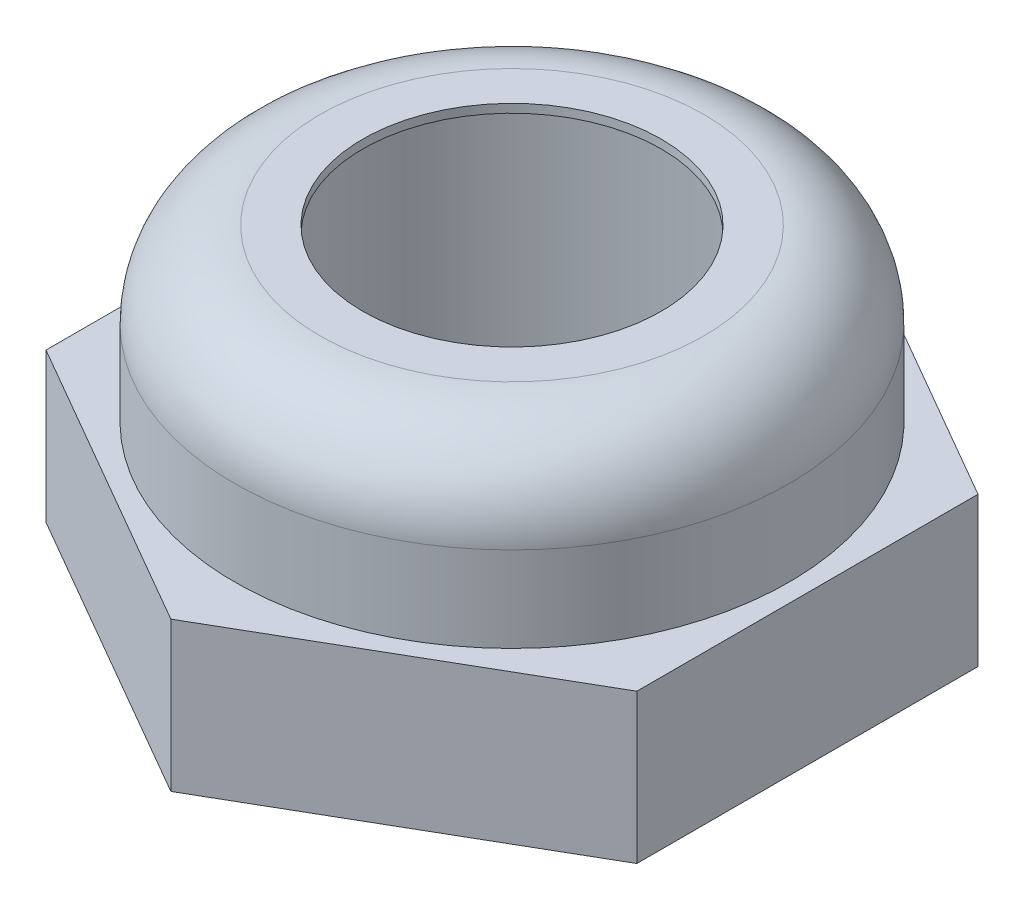
ISO-10303-21;
HEADER;
FILE_DESCRIPTION(('STEP AP214'),'2;1');
FILE_NAME('part.step','',(''),(''),'','','');
FILE_SCHEMA(('AUTOMOTIVE_DESIGN { 1 0 10303 214 1 1 1 1 }'));
ENDSEC;
DATA;
#1=APPLICATION_CONTEXT('core data for automotive mechanical design processes');
#2=APPLICATION_PROTOCOL_DEFINITION('international standard','automotive_design',2000,#1);
#3=PRODUCT_CONTEXT('',#1,'mechanical');
#4=PRODUCT('Part','Part','',(#3));
#5=PRODUCT_RELATED_PRODUCT_CATEGORY('part','',(#4));
#6=PRODUCT_DEFINITION_FORMATION('','',#4);
#7=PRODUCT_DEFINITION_CONTEXT('part definition',#1,'design');
#8=PRODUCT_DEFINITION('design','',#6,#7);
#9=PRODUCT_DEFINITION_SHAPE('','',#8);
#10=(LENGTH_UNIT() NAMED_UNIT(*) SI_UNIT(.MILLI.,.METRE.));
#11=(NAMED_UNIT(*) PLANE_ANGLE_UNIT() SI_UNIT($,.RADIAN.));
#12=(NAMED_UNIT(*) SI_UNIT($,.STERADIAN.) SOLID_ANGLE_UNIT());
#13=UNCERTAINTY_MEASURE_WITH_UNIT(LENGTH_MEASURE(1.E-05),#10,'distance_accuracy_value','');
#14=(GEOMETRIC_REPRESENTATION_CONTEXT(3) GLOBAL_UNCERTAINTY_ASSIGNED_CONTEXT((#13)) GLOBAL_UNIT_ASSIGNED_CONTEXT((#10,
#11,#12)) REPRESENTATION_CONTEXT('',''));
#15=CARTESIAN_POINT('',(0.,0.,0.));
#16=DIRECTION('',(0.,0.,1.));
#17=DIRECTION('',(1.,0.,0.));
#18=AXIS2_PLACEMENT_3D('',#15,#16,#17);
#19=CARTESIAN_POINT('',(-6.5,-3.47319206126624,0.));
#20=DIRECTION('',(0.,-1.,0.));
#21=DIRECTION('',(0.,0.,-1.));
#22=AXIS2_PLACEMENT_3D('',#19,#20,#21);
#23=PLANE('',#22);
#24=CARTESIAN_POINT('',(0.,-3.47319206126623,0.));
#25=DIRECTION('',(0.,-1.,0.));
#26=DIRECTION('',(0.,0.,-1.));
#27=AXIS2_PLACEMENT_3D('',#24,#25,#26);
#28=CIRCLE('',#27,6.5);
#29=CARTESIAN_POINT('',(0.,-3.47319206126623,-6.5));
#30=VERTEX_POINT('',#29);
#31=EDGE_CURVE('E172',#30,#30,#28,.T.);
#32=ORIENTED_EDGE('',*,*,#31,.T.);
#33=EDGE_LOOP('',(#32));
#34=FACE_BOUND('',#33,.T.);
#35=DIRECTION('',(-0.866025403784439,0.,0.5));
#36=VECTOR('',#35,1.);
#37=CARTESIAN_POINT('',(-6.92820323027551,-3.47319206126624,-4.));
#38=LINE('',#37,#36);
#39=CARTESIAN_POINT('',(0.,-3.47319206126624,-8.));
#40=VERTEX_POINT('',#39);
#41=CARTESIAN_POINT('',(-6.92820323027551,-3.47319206126624,-4.));
#42=VERTEX_POINT('',#41);
#43=EDGE_CURVE('E109',#40,#42,#38,.T.);
#44=ORIENTED_EDGE('',*,*,#43,.T.);
#45=DIRECTION('',(0.,0.,1.));
#46=VECTOR('',#45,1.);
#47=CARTESIAN_POINT('',(-6.92820323027551,-3.47319206126624,4.));
#48=LINE('',#47,#46);
#49=CARTESIAN_POINT('',(-6.92820323027551,-3.47319206126624,4.));
#50=VERTEX_POINT('',#49);
#51=EDGE_CURVE('E107',#42,#50,#48,.T.);
#52=ORIENTED_EDGE('',*,*,#51,.T.);
#53=DIRECTION('',(0.866025403784439,0.,0.5));
#54=VECTOR('',#53,1.);
#55=CARTESIAN_POINT('',(0.,-3.47319206126624,8.));
#56=LINE('',#55,#54);
#57=CARTESIAN_POINT('',(0.,-3.47319206126624,8.));
#58=VERTEX_POINT('',#57);
#59=EDGE_CURVE('E50',#50,#58,#56,.T.);
#60=ORIENTED_EDGE('',*,*,#59,.T.);
#61=DIRECTION('',(0.866025403784439,0.,-0.5));
#62=VECTOR('',#61,1.);
#63=CARTESIAN_POINT('',(6.92820323027551,-3.47319206126624,4.));
#64=LINE('',#63,#62);
#65=CARTESIAN_POINT('',(6.92820323027551,-3.47319206126624,4.));
#66=VERTEX_POINT('',#65);
#67=EDGE_CURVE('E97',#58,#66,#64,.T.);
#68=ORIENTED_EDGE('',*,*,#67,.T.);
#69=DIRECTION('',(0.,0.,-1.));
#70=VECTOR('',#69,1.);
#71=CARTESIAN_POINT('',(6.92820323027551,-3.47319206126624,-4.));
#72=LINE('',#71,#70);
#73=CARTESIAN_POINT('',(6.92820323027551,-3.47319206126624,-4.));
#74=VERTEX_POINT('',#73);
#75=EDGE_CURVE('E103',#66,#74,#72,.T.);
#76=ORIENTED_EDGE('',*,*,#75,.T.);
#77=DIRECTION('',(-0.866025403784439,0.,-0.5));
#78=VECTOR('',#77,1.);
#79=CARTESIAN_POINT('',(0.,-3.47319206126624,-8.));
#80=LINE('',#79,#78);
#81=EDGE_CURVE('E114',#74,#40,#80,.T.);
#82=ORIENTED_EDGE('',*,*,#81,.T.);
#83=EDGE_LOOP('',(#44,#52,#60,#68,#76,#82));
#84=FACE_BOUND('',#83,.T.);
#85=ADVANCED_FACE('F35',(#34,#84),#23,.F.);
#86=CARTESIAN_POINT('',(-8.,-6.97319206126624,0.));
#87=DIRECTION('',(0.,1.,0.));
#88=DIRECTION('',(0.,0.,1.));
#89=AXIS2_PLACEMENT_3D('',#86,#87,#88);
#90=PLANE('',#89);
#91=CARTESIAN_POINT('',(0.,-6.97319206126624,0.));
#92=DIRECTION('',(0.,-1.,0.));
#93=DIRECTION('',(0.,0.,-1.));
#94=AXIS2_PLACEMENT_3D('',#91,#92,#93);
#95=CIRCLE('',#94,6.);
#96=CARTESIAN_POINT('',(0.,-6.97319206126624,-6.));
#97=VERTEX_POINT('',#96);
#98=EDGE_CURVE('E223',#97,#97,#95,.T.);
#99=ORIENTED_EDGE('',*,*,#98,.F.);
#100=EDGE_LOOP('',(#99));
#101=FACE_BOUND('',#100,.T.);
#102=DIRECTION('',(-0.866025403784439,0.,0.5));
#103=VECTOR('',#102,1.);
#104=CARTESIAN_POINT('',(-9.46410161513776,-6.97319206126624,-2.53589838486225));
#105=LINE('',#104,#103);
#106=CARTESIAN_POINT('',(0.,-6.97319206126624,-8.));
#107=VERTEX_POINT('',#106);
#108=CARTESIAN_POINT('',(-6.92820323027551,-6.97319206126624,-4.));
#109=VERTEX_POINT('',#108);
#110=EDGE_CURVE('E11',#107,#109,#105,.T.);
#111=ORIENTED_EDGE('',*,*,#110,.F.);
#112=DIRECTION('',(-0.866025403784439,0.,-0.5));
#113=VECTOR('',#112,1.);
#114=CARTESIAN_POINT('',(-2.53589838486225,-6.97319206126624,-9.46410161513775));
#115=LINE('',#114,#113);
#116=CARTESIAN_POINT('',(6.92820323027551,-6.97319206126624,-4.));
#117=VERTEX_POINT('',#116);
#118=EDGE_CURVE('E43',#117,#107,#115,.T.);
#119=ORIENTED_EDGE('',*,*,#118,.F.);
#120=DIRECTION('',(0.,0.,-1.));
#121=VECTOR('',#120,1.);
#122=CARTESIAN_POINT('',(6.92820323027551,-6.97319206126624,0.));
#123=LINE('',#122,#121);
#124=CARTESIAN_POINT('',(6.92820323027551,-6.97319206126624,4.));
#125=VERTEX_POINT('',#124);
#126=EDGE_CURVE('E179',#125,#117,#123,.T.);
#127=ORIENTED_EDGE('',*,*,#126,.F.);
#128=DIRECTION('',(0.866025403784439,0.,-0.5));
#129=VECTOR('',#128,1.);
#130=CARTESIAN_POINT('',(-2.53589838486224,-6.97319206126624,9.46410161513775));
#131=LINE('',#130,#129);
#132=CARTESIAN_POINT('',(0.,-6.97319206126624,8.));
#133=VERTEX_POINT('',#132);
#134=EDGE_CURVE('E177',#133,#125,#131,.T.);
#135=ORIENTED_EDGE('',*,*,#134,.F.);
#136=DIRECTION('',(0.866025403784439,0.,0.5));
#137=VECTOR('',#136,1.);
#138=CARTESIAN_POINT('',(-9.46410161513776,-6.97319206126624,2.53589838486225));
#139=LINE('',#138,#137);
#140=CARTESIAN_POINT('',(-6.92820323027551,-6.97319206126624,4.));
#141=VERTEX_POINT('',#140);
#142=EDGE_CURVE('E90',#141,#133,#139,.T.);
#143=ORIENTED_EDGE('',*,*,#142,.F.);
#144=DIRECTION('',(0.,0.,1.));
#145=VECTOR('',#144,1.);
#146=CARTESIAN_POINT('',(-6.92820323027551,-6.97319206126624,0.));
#147=LINE('',#146,#145);
#148=EDGE_CURVE('E169',#109,#141,#147,.T.);
#149=ORIENTED_EDGE('',*,*,#148,.F.);
#150=EDGE_LOOP('',(#111,#119,#127,#135,#143,#149));
#151=FACE_BOUND('',#150,.T.);
#152=ADVANCED_FACE('F146',(#101,#151),#90,.F.);
#153=CARTESIAN_POINT('',(-4.49999999999998,0.526807938733765,0.));
#154=DIRECTION('',(0.,-1.,0.));
#155=DIRECTION('',(0.,0.,-1.));
#156=AXIS2_PLACEMENT_3D('',#153,#154,#155);
#157=PLANE('',#156);
#158=CARTESIAN_POINT('',(0.,0.526807938733766,0.));
#159=DIRECTION('',(0.,-1.,0.));
#160=DIRECTION('',(0.,0.,-1.));
#161=AXIS2_PLACEMENT_3D('',#158,#159,#160);
#162=CIRCLE('',#161,4.49999999999999);
#163=CARTESIAN_POINT('',(0.,0.526807938733766,-4.49999999999999));
#164=VERTEX_POINT('',#163);
#165=EDGE_CURVE('E168',#164,#164,#162,.T.);
#166=ORIENTED_EDGE('',*,*,#165,.F.);
#167=EDGE_LOOP('',(#166));
#168=FACE_BOUND('',#167,.T.);
#169=CARTESIAN_POINT('',(0.,0.526807938733766,0.));
#170=DIRECTION('',(0.,-1.,0.));
#171=DIRECTION('',(0.,0.,-1.));
#172=AXIS2_PLACEMENT_3D('',#169,#170,#171);
#173=CIRCLE('',#172,3.5);
#174=CARTESIAN_POINT('',(0.,0.526807938733766,-3.5));
#175=VERTEX_POINT('',#174);
#176=EDGE_CURVE('E119',#175,#175,#173,.T.);
#177=ORIENTED_EDGE('',*,*,#176,.T.);
#178=EDGE_LOOP('',(#177));
#179=FACE_BOUND('',#178,.T.);
#180=ADVANCED_FACE('F37',(#168,#179),#157,.F.);
#181=CARTESIAN_POINT('',(0.,-1.47319206126624,0.));
#182=DIRECTION('',(0.,-1.,0.));
#183=DIRECTION('',(0.,0.,-1.));
#184=AXIS2_PLACEMENT_3D('',#181,#182,#183);
#185=TOROIDAL_SURFACE('',#184,4.5,2.);
#186=CARTESIAN_POINT('',(0.,-1.47319206126625,0.));
#187=DIRECTION('',(0.,-1.,0.));
#188=DIRECTION('',(0.,0.,-1.));
#189=AXIS2_PLACEMENT_3D('',#186,#187,#188);
#190=CIRCLE('',#189,6.5);
#191=CARTESIAN_POINT('',(0.,-1.47319206126625,-6.5));
#192=VERTEX_POINT('',#191);
#193=EDGE_CURVE('E165',#192,#192,#190,.T.);
#194=ORIENTED_EDGE('',*,*,#193,.F.);
#195=EDGE_LOOP('',(#194));
#196=FACE_BOUND('',#195,.T.);
#197=ORIENTED_EDGE('',*,*,#165,.T.);
#198=EDGE_LOOP('',(#197));
#199=FACE_BOUND('',#198,.T.);
#200=ADVANCED_FACE('F154',(#196,#199),#185,.T.);
#201=CARTESIAN_POINT('',(0.,-7.79203512625064,0.));
#202=DIRECTION('',(0.,-1.,0.));
#203=DIRECTION('',(0.,0.,-1.));
#204=AXIS2_PLACEMENT_3D('',#201,#202,#203);
#205=CYLINDRICAL_SURFACE('',#204,6.5);
#206=ORIENTED_EDGE('',*,*,#31,.F.);
#207=EDGE_LOOP('',(#206));
#208=FACE_BOUND('',#207,.T.);
#209=ORIENTED_EDGE('',*,*,#193,.T.);
#210=EDGE_LOOP('',(#209));
#211=FACE_BOUND('',#210,.T.);
#212=ADVANCED_FACE('F144',(#208,#211),#205,.T.);
#213=CARTESIAN_POINT('',(0.,-7.79203512625064,0.));
#214=DIRECTION('',(0.,-1.,0.));
#215=DIRECTION('',(0.,0.,-1.));
#216=AXIS2_PLACEMENT_3D('',#213,#214,#215);
#217=CYLINDRICAL_SURFACE('',#216,6.);
#218=CARTESIAN_POINT('',(0.,-0.973192061266235,0.));
#219=DIRECTION('',(0.,-1.,0.));
#220=DIRECTION('',(0.,0.,-1.));
#221=AXIS2_PLACEMENT_3D('',#218,#219,#220);
#222=CIRCLE('',#221,6.);
#223=CARTESIAN_POINT('',(0.,-0.973192061266235,-6.));
#224=VERTEX_POINT('',#223);
#225=EDGE_CURVE('E221',#224,#224,#222,.T.);
#226=ORIENTED_EDGE('',*,*,#225,.F.);
#227=EDGE_LOOP('',(#226));
#228=FACE_BOUND('',#227,.T.);
#229=ORIENTED_EDGE('',*,*,#98,.T.);
#230=EDGE_LOOP('',(#229));
#231=FACE_BOUND('',#230,.T.);
#232=ADVANCED_FACE('F139',(#228,#231),#217,.F.);
#233=CARTESIAN_POINT('',(-6.,-0.973192061266235,0.));
#234=CARTESIAN_POINT('',(-5.27041384153989,0.380623502710062,0.));
#235=CARTESIAN_POINT('',(-3.5,0.326807938733765,0.));
#236=B_SPLINE_CURVE_WITH_KNOTS('',2,(#233,#234,#235),.UNSPECIFIED.,.F.,.F.,(3,3),(0.,1.),.UNSPECIFIED.);
#237=CARTESIAN_POINT('',(0.,-7.79203512625064,0.));
#238=DIRECTION('',(0.,-1.,0.));
#239=AXIS1_PLACEMENT('',#237,#238);
#240=SURFACE_OF_REVOLUTION('',#236,#239);
#241=CARTESIAN_POINT('',(0.,0.326807938733765,0.));
#242=DIRECTION('',(0.,-1.,0.));
#243=DIRECTION('',(0.,0.,-1.));
#244=AXIS2_PLACEMENT_3D('',#241,#242,#243);
#245=CIRCLE('',#244,3.5);
#246=CARTESIAN_POINT('',(0.,0.326807938733765,-3.5));
#247=VERTEX_POINT('',#246);
#248=EDGE_CURVE('E220',#247,#247,#245,.T.);
#249=ORIENTED_EDGE('',*,*,#248,.F.);
#250=EDGE_LOOP('',(#249));
#251=FACE_BOUND('',#250,.T.);
#252=ORIENTED_EDGE('',*,*,#225,.T.);
#253=EDGE_LOOP('',(#252));
#254=FACE_BOUND('',#253,.T.);
#255=ADVANCED_FACE('F134',(#251,#254),#240,.T.);
#256=CARTESIAN_POINT('',(0.,-7.79203512625064,0.));
#257=DIRECTION('',(0.,-1.,0.));
#258=DIRECTION('',(0.,0.,-1.));
#259=AXIS2_PLACEMENT_3D('',#256,#257,#258);
#260=CYLINDRICAL_SURFACE('',#259,3.5);
#261=ORIENTED_EDGE('',*,*,#176,.F.);
#262=EDGE_LOOP('',(#261));
#263=FACE_BOUND('',#262,.T.);
#264=ORIENTED_EDGE('',*,*,#248,.T.);
#265=EDGE_LOOP('',(#264));
#266=FACE_BOUND('',#265,.T.);
#267=ADVANCED_FACE('F138',(#263,#266),#260,.F.);
#268=CARTESIAN_POINT('',(-6.92820323027551,-13.4731920612662,-4.));
#269=DIRECTION('',(-0.5,0.,-0.866025403784439));
#270=DIRECTION('',(-0.866025403784439,0.,0.5));
#271=AXIS2_PLACEMENT_3D('',#268,#269,#270);
#272=PLANE('',#271);
#273=ORIENTED_EDGE('',*,*,#110,.T.);
#274=DIRECTION('',(0.,1.,0.));
#275=VECTOR('',#274,1.);
#276=CARTESIAN_POINT('',(-6.92820323027551,-13.4731920612662,-4.));
#277=LINE('',#276,#275);
#278=EDGE_CURVE('E58',#109,#42,#277,.T.);
#279=ORIENTED_EDGE('',*,*,#278,.T.);
#280=ORIENTED_EDGE('',*,*,#43,.F.);
#281=DIRECTION('',(0.,1.,0.));
#282=VECTOR('',#281,1.);
#283=CARTESIAN_POINT('',(0.,-13.4731920612662,-8.));
#284=LINE('',#283,#282);
#285=EDGE_CURVE('E117',#107,#40,#284,.T.);
#286=ORIENTED_EDGE('',*,*,#285,.F.);
#287=EDGE_LOOP('',(#273,#279,#280,#286));
#288=FACE_BOUND('',#287,.T.);
#289=ADVANCED_FACE('F191',(#288),#272,.T.);
#290=CARTESIAN_POINT('',(0.,-13.4731920612662,-8.));
#291=DIRECTION('',(0.5,0.,-0.866025403784439));
#292=DIRECTION('',(-0.866025403784439,0.,-0.5));
#293=AXIS2_PLACEMENT_3D('',#290,#291,#292);
#294=PLANE('',#293);
#295=ORIENTED_EDGE('',*,*,#118,.T.);
#296=ORIENTED_EDGE('',*,*,#285,.T.);
#297=ORIENTED_EDGE('',*,*,#81,.F.);
#298=DIRECTION('',(0.,1.,0.));
#299=VECTOR('',#298,1.);
#300=CARTESIAN_POINT('',(6.92820323027551,-13.4731920612662,-4.));
#301=LINE('',#300,#299);
#302=EDGE_CURVE('E120',#117,#74,#301,.T.);
#303=ORIENTED_EDGE('',*,*,#302,.F.);
#304=EDGE_LOOP('',(#295,#296,#297,#303));
#305=FACE_BOUND('',#304,.T.);
#306=ADVANCED_FACE('F184',(#305),#294,.T.);
#307=CARTESIAN_POINT('',(6.92820323027551,-13.4731920612662,-4.));
#308=DIRECTION('',(1.,0.,0.));
#309=DIRECTION('',(0.,0.,-1.));
#310=AXIS2_PLACEMENT_3D('',#307,#308,#309);
#311=PLANE('',#310);
#312=ORIENTED_EDGE('',*,*,#126,.T.);
#313=ORIENTED_EDGE('',*,*,#302,.T.);
#314=ORIENTED_EDGE('',*,*,#75,.F.);
#315=DIRECTION('',(0.,1.,0.));
#316=VECTOR('',#315,1.);
#317=CARTESIAN_POINT('',(6.92820323027551,-13.4731920612662,4.));
#318=LINE('',#317,#316);
#319=EDGE_CURVE('E93',#125,#66,#318,.T.);
#320=ORIENTED_EDGE('',*,*,#319,.F.);
#321=EDGE_LOOP('',(#312,#313,#314,#320));
#322=FACE_BOUND('',#321,.T.);
#323=ADVANCED_FACE('F195',(#322),#311,.T.);
#324=CARTESIAN_POINT('',(6.92820323027551,-13.4731920612662,4.));
#325=DIRECTION('',(0.5,0.,0.866025403784439));
#326=DIRECTION('',(0.866025403784439,0.,-0.5));
#327=AXIS2_PLACEMENT_3D('',#324,#325,#326);
#328=PLANE('',#327);
#329=ORIENTED_EDGE('',*,*,#134,.T.);
#330=ORIENTED_EDGE('',*,*,#319,.T.);
#331=ORIENTED_EDGE('',*,*,#67,.F.);
#332=DIRECTION('',(0.,1.,0.));
#333=VECTOR('',#332,1.);
#334=CARTESIAN_POINT('',(0.,-13.4731920612662,8.));
#335=LINE('',#334,#333);
#336=EDGE_CURVE('E86',#133,#58,#335,.T.);
#337=ORIENTED_EDGE('',*,*,#336,.F.);
#338=EDGE_LOOP('',(#329,#330,#331,#337));
#339=FACE_BOUND('',#338,.T.);
#340=ADVANCED_FACE('F98',(#339),#328,.T.);
#341=CARTESIAN_POINT('',(0.,-13.4731920612662,8.));
#342=DIRECTION('',(-0.5,0.,0.866025403784439));
#343=DIRECTION('',(0.866025403784439,0.,0.5));
#344=AXIS2_PLACEMENT_3D('',#341,#342,#343);
#345=PLANE('',#344);
#346=ORIENTED_EDGE('',*,*,#142,.T.);
#347=ORIENTED_EDGE('',*,*,#336,.T.);
#348=ORIENTED_EDGE('',*,*,#59,.F.);
#349=DIRECTION('',(0.,1.,0.));
#350=VECTOR('',#349,1.);
#351=CARTESIAN_POINT('',(-6.92820323027551,-13.4731920612662,4.));
#352=LINE('',#351,#350);
#353=EDGE_CURVE('E94',#141,#50,#352,.T.);
#354=ORIENTED_EDGE('',*,*,#353,.F.);
#355=EDGE_LOOP('',(#346,#347,#348,#354));
#356=FACE_BOUND('',#355,.T.);
#357=ADVANCED_FACE('F88',(#356),#345,.T.);
#358=CARTESIAN_POINT('',(-6.92820323027551,-13.4731920612662,4.));
#359=DIRECTION('',(-1.,0.,0.));
#360=DIRECTION('',(0.,0.,1.));
#361=AXIS2_PLACEMENT_3D('',#358,#359,#360);
#362=PLANE('',#361);
#363=ORIENTED_EDGE('',*,*,#148,.T.);
#364=ORIENTED_EDGE('',*,*,#353,.T.);
#365=ORIENTED_EDGE('',*,*,#51,.F.);
#366=ORIENTED_EDGE('',*,*,#278,.F.);
#367=EDGE_LOOP('',(#363,#364,#365,#366));
#368=FACE_BOUND('',#367,.T.);
#369=ADVANCED_FACE('F193',(#368),#362,.T.);
#370=CLOSED_SHELL('',(#85,#152,#180,#200,#212,#232,#255,#267,#289,#306,#323,#340,#357,#369));
#371=MANIFOLD_SOLID_BREP('B2',#370);
#372=ADVANCED_BREP_SHAPE_REPRESENTATION('',(#18,#371),#14);
#373=SHAPE_DEFINITION_REPRESENTATION(#9,#372);
ENDSEC;
END-ISO-10303-21;
